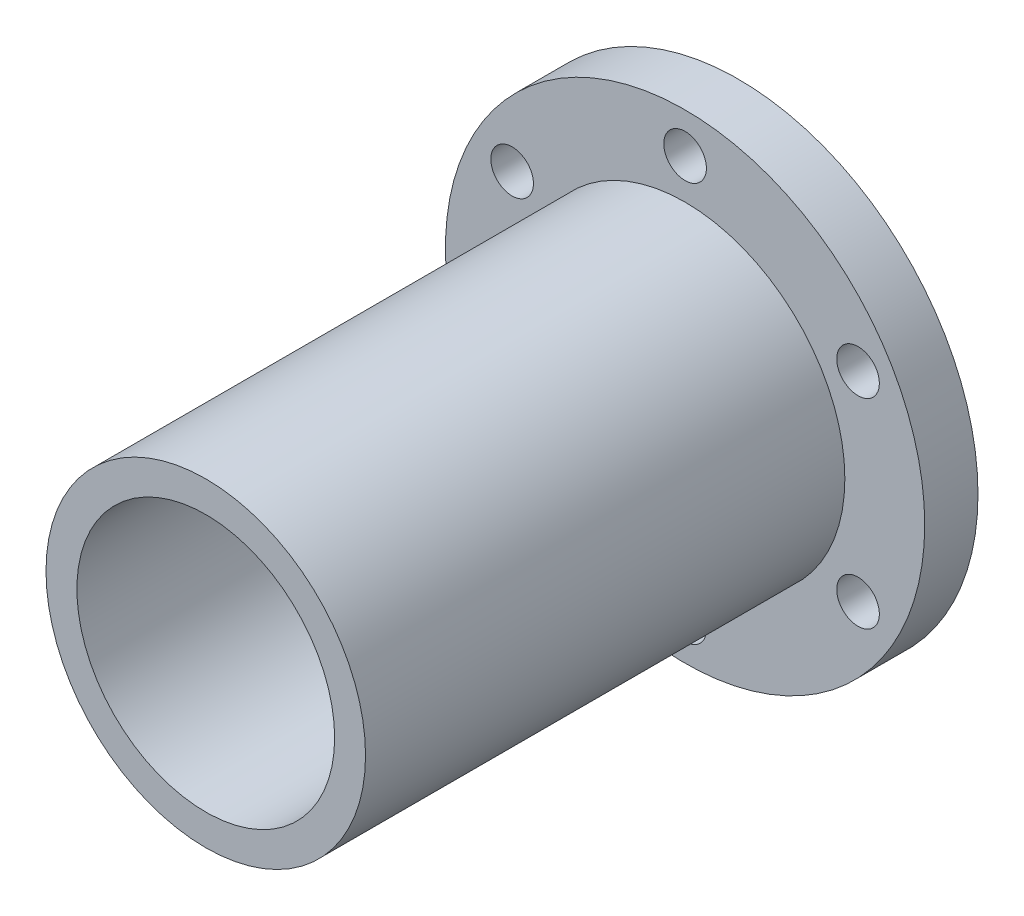
ISO-10303-21;
HEADER;
FILE_DESCRIPTION(('STEP AP214'),'2;1');
FILE_NAME('part.step','',(''),(''),'','','');
FILE_SCHEMA(('AUTOMOTIVE_DESIGN { 1 0 10303 214 1 1 1 1 }'));
ENDSEC;
DATA;
#1=APPLICATION_CONTEXT('core data for automotive mechanical design processes');
#2=APPLICATION_PROTOCOL_DEFINITION('international standard','automotive_design',2000,#1);
#3=PRODUCT_CONTEXT('',#1,'mechanical');
#4=PRODUCT('Part','Part','',(#3));
#5=PRODUCT_RELATED_PRODUCT_CATEGORY('part','',(#4));
#6=PRODUCT_DEFINITION_FORMATION('','',#4);
#7=PRODUCT_DEFINITION_CONTEXT('part definition',#1,'design');
#8=PRODUCT_DEFINITION('design','',#6,#7);
#9=PRODUCT_DEFINITION_SHAPE('','',#8);
#10=(LENGTH_UNIT() NAMED_UNIT(*) SI_UNIT(.MILLI.,.METRE.));
#11=(NAMED_UNIT(*) PLANE_ANGLE_UNIT() SI_UNIT($,.RADIAN.));
#12=(NAMED_UNIT(*) SI_UNIT($,.STERADIAN.) SOLID_ANGLE_UNIT());
#13=UNCERTAINTY_MEASURE_WITH_UNIT(LENGTH_MEASURE(1.E-05),#10,'distance_accuracy_value','');
#14=(GEOMETRIC_REPRESENTATION_CONTEXT(3) GLOBAL_UNCERTAINTY_ASSIGNED_CONTEXT((#13)) GLOBAL_UNIT_ASSIGNED_CONTEXT((#10,
#11,#12)) REPRESENTATION_CONTEXT('',''));
#15=CARTESIAN_POINT('',(0.,0.,0.));
#16=DIRECTION('',(0.,0.,1.));
#17=DIRECTION('',(1.,0.,0.));
#18=AXIS2_PLACEMENT_3D('',#15,#16,#17);
#19=CARTESIAN_POINT('',(0.,0.,5.));
#20=DIRECTION('',(0.,0.,-1.));
#21=DIRECTION('',(-1.,0.,0.));
#22=AXIS2_PLACEMENT_3D('',#19,#20,#21);
#23=CYLINDRICAL_SURFACE('',#22,22.5);
#24=CARTESIAN_POINT('',(0.,0.,5.));
#25=DIRECTION('',(0.,0.,1.));
#26=DIRECTION('',(1.,0.,0.));
#27=AXIS2_PLACEMENT_3D('',#24,#25,#26);
#28=CIRCLE('',#27,22.5);
#29=CARTESIAN_POINT('',(22.5,0.,5.));
#30=VERTEX_POINT('',#29);
#31=EDGE_CURVE('E40',#30,#30,#28,.T.);
#32=ORIENTED_EDGE('',*,*,#31,.F.);
#33=EDGE_LOOP('',(#32));
#34=FACE_BOUND('',#33,.T.);
#35=CARTESIAN_POINT('',(0.,0.,0.));
#36=DIRECTION('',(0.,0.,1.));
#37=DIRECTION('',(1.,0.,0.));
#38=AXIS2_PLACEMENT_3D('',#35,#36,#37);
#39=CIRCLE('',#38,22.5);
#40=CARTESIAN_POINT('',(22.5,0.,0.));
#41=VERTEX_POINT('',#40);
#42=EDGE_CURVE('E44',#41,#41,#39,.T.);
#43=ORIENTED_EDGE('',*,*,#42,.T.);
#44=EDGE_LOOP('',(#43));
#45=FACE_BOUND('',#44,.T.);
#46=ADVANCED_FACE('F34',(#34,#45),#23,.T.);
#47=CARTESIAN_POINT('',(0.,0.,5.));
#48=DIRECTION('',(0.,0.,1.));
#49=DIRECTION('',(1.,0.,0.));
#50=AXIS2_PLACEMENT_3D('',#47,#48,#49);
#51=PLANE('',#50);
#52=CARTESIAN_POINT('',(0.,18.75,5.));
#53=DIRECTION('',(0.,0.,1.));
#54=DIRECTION('',(1.,0.,0.));
#55=AXIS2_PLACEMENT_3D('',#52,#53,#54);
#56=CIRCLE('',#55,2.);
#57=CARTESIAN_POINT('',(2.,18.75,5.));
#58=VERTEX_POINT('',#57);
#59=EDGE_CURVE('E85',#58,#58,#56,.T.);
#60=ORIENTED_EDGE('',*,*,#59,.F.);
#61=EDGE_LOOP('',(#60));
#62=FACE_BOUND('',#61,.T.);
#63=CARTESIAN_POINT('',(-16.2379763209579,9.37499999999942,5.));
#64=DIRECTION('',(0.,0.,1.));
#65=DIRECTION('',(1.,0.,0.));
#66=AXIS2_PLACEMENT_3D('',#63,#64,#65);
#67=CIRCLE('',#66,2.);
#68=CARTESIAN_POINT('',(-14.2379763209579,9.37499999999942,5.));
#69=VERTEX_POINT('',#68);
#70=EDGE_CURVE('E86',#69,#69,#67,.T.);
#71=ORIENTED_EDGE('',*,*,#70,.F.);
#72=EDGE_LOOP('',(#71));
#73=FACE_BOUND('',#72,.T.);
#74=CARTESIAN_POINT('',(-16.2379763209572,-9.37500000000058,5.));
#75=DIRECTION('',(0.,0.,1.));
#76=DIRECTION('',(1.,0.,0.));
#77=AXIS2_PLACEMENT_3D('',#74,#75,#76);
#78=CIRCLE('',#77,2.);
#79=CARTESIAN_POINT('',(-14.2379763209572,-9.37500000000058,5.));
#80=VERTEX_POINT('',#79);
#81=EDGE_CURVE('E60',#80,#80,#78,.T.);
#82=ORIENTED_EDGE('',*,*,#81,.F.);
#83=EDGE_LOOP('',(#82));
#84=FACE_BOUND('',#83,.T.);
#85=CARTESIAN_POINT('',(1.32579492414538E-12,-18.75,5.));
#86=DIRECTION('',(0.,0.,1.));
#87=DIRECTION('',(1.,0.,0.));
#88=AXIS2_PLACEMENT_3D('',#85,#86,#87);
#89=CIRCLE('',#88,2.);
#90=CARTESIAN_POINT('',(2.00000000000133,-18.75,5.));
#91=VERTEX_POINT('',#90);
#92=EDGE_CURVE('E67',#91,#91,#89,.T.);
#93=ORIENTED_EDGE('',*,*,#92,.F.);
#94=EDGE_LOOP('',(#93));
#95=FACE_BOUND('',#94,.T.);
#96=CARTESIAN_POINT('',(16.2379763209592,-9.37499999999942,5.));
#97=DIRECTION('',(0.,0.,1.));
#98=DIRECTION('',(1.,0.,0.));
#99=AXIS2_PLACEMENT_3D('',#96,#97,#98);
#100=CIRCLE('',#99,2.00000000000001);
#101=CARTESIAN_POINT('',(18.2379763209592,-9.37499999999942,5.));
#102=VERTEX_POINT('',#101);
#103=EDGE_CURVE('E73',#102,#102,#100,.T.);
#104=ORIENTED_EDGE('',*,*,#103,.F.);
#105=EDGE_LOOP('',(#104));
#106=FACE_BOUND('',#105,.T.);
#107=CARTESIAN_POINT('',(16.2379763209586,9.37500000000058,5.));
#108=DIRECTION('',(0.,0.,1.));
#109=DIRECTION('',(1.,0.,0.));
#110=AXIS2_PLACEMENT_3D('',#107,#108,#109);
#111=CIRCLE('',#110,2.00000000000001);
#112=CARTESIAN_POINT('',(18.2379763209586,9.37500000000058,5.));
#113=VERTEX_POINT('',#112);
#114=EDGE_CURVE('E79',#113,#113,#111,.T.);
#115=ORIENTED_EDGE('',*,*,#114,.F.);
#116=EDGE_LOOP('',(#115));
#117=FACE_BOUND('',#116,.T.);
#118=CARTESIAN_POINT('',(0.,0.,5.));
#119=DIRECTION('',(0.,0.,1.));
#120=DIRECTION('',(1.,0.,0.));
#121=AXIS2_PLACEMENT_3D('',#118,#119,#120);
#122=CIRCLE('',#121,15.);
#123=CARTESIAN_POINT('',(15.,0.,5.));
#124=VERTEX_POINT('',#123);
#125=EDGE_CURVE('E51',#124,#124,#122,.T.);
#126=ORIENTED_EDGE('',*,*,#125,.F.);
#127=EDGE_LOOP('',(#126));
#128=FACE_BOUND('',#127,.T.);
#129=ORIENTED_EDGE('',*,*,#31,.T.);
#130=EDGE_LOOP('',(#129));
#131=FACE_BOUND('',#130,.T.);
#132=ADVANCED_FACE('F106',(#62,#73,#84,#95,#106,#117,#128,#131),#51,.T.);
#133=CARTESIAN_POINT('',(0.,0.,0.));
#134=DIRECTION('',(0.,0.,1.));
#135=DIRECTION('',(1.,0.,0.));
#136=AXIS2_PLACEMENT_3D('',#133,#134,#135);
#137=PLANE('',#136);
#138=CARTESIAN_POINT('',(0.,18.75,0.));
#139=DIRECTION('',(0.,0.,1.));
#140=DIRECTION('',(1.,0.,0.));
#141=AXIS2_PLACEMENT_3D('',#138,#139,#140);
#142=CIRCLE('',#141,2.);
#143=CARTESIAN_POINT('',(2.,18.75,0.));
#144=VERTEX_POINT('',#143);
#145=EDGE_CURVE('E59',#144,#144,#142,.T.);
#146=ORIENTED_EDGE('',*,*,#145,.T.);
#147=EDGE_LOOP('',(#146));
#148=FACE_BOUND('',#147,.T.);
#149=CARTESIAN_POINT('',(-16.2379763209579,9.37499999999942,0.));
#150=DIRECTION('',(0.,0.,1.));
#151=DIRECTION('',(1.,0.,0.));
#152=AXIS2_PLACEMENT_3D('',#149,#150,#151);
#153=CIRCLE('',#152,2.);
#154=CARTESIAN_POINT('',(-14.2379763209579,9.37499999999942,0.));
#155=VERTEX_POINT('',#154);
#156=EDGE_CURVE('E64',#155,#155,#153,.T.);
#157=ORIENTED_EDGE('',*,*,#156,.T.);
#158=EDGE_LOOP('',(#157));
#159=FACE_BOUND('',#158,.T.);
#160=CARTESIAN_POINT('',(-16.2379763209572,-9.37500000000058,0.));
#161=DIRECTION('',(0.,0.,1.));
#162=DIRECTION('',(1.,0.,0.));
#163=AXIS2_PLACEMENT_3D('',#160,#161,#162);
#164=CIRCLE('',#163,2.);
#165=CARTESIAN_POINT('',(-14.2379763209572,-9.37500000000058,0.));
#166=VERTEX_POINT('',#165);
#167=EDGE_CURVE('E63',#166,#166,#164,.T.);
#168=ORIENTED_EDGE('',*,*,#167,.T.);
#169=EDGE_LOOP('',(#168));
#170=FACE_BOUND('',#169,.T.);
#171=CARTESIAN_POINT('',(1.32579492414538E-12,-18.75,0.));
#172=DIRECTION('',(0.,0.,1.));
#173=DIRECTION('',(1.,0.,0.));
#174=AXIS2_PLACEMENT_3D('',#171,#172,#173);
#175=CIRCLE('',#174,2.);
#176=CARTESIAN_POINT('',(2.00000000000133,-18.75,0.));
#177=VERTEX_POINT('',#176);
#178=EDGE_CURVE('E70',#177,#177,#175,.T.);
#179=ORIENTED_EDGE('',*,*,#178,.T.);
#180=EDGE_LOOP('',(#179));
#181=FACE_BOUND('',#180,.T.);
#182=CARTESIAN_POINT('',(16.2379763209592,-9.37499999999942,0.));
#183=DIRECTION('',(0.,0.,1.));
#184=DIRECTION('',(1.,0.,0.));
#185=AXIS2_PLACEMENT_3D('',#182,#183,#184);
#186=CIRCLE('',#185,2.00000000000001);
#187=CARTESIAN_POINT('',(18.2379763209592,-9.37499999999942,0.));
#188=VERTEX_POINT('',#187);
#189=EDGE_CURVE('E76',#188,#188,#186,.T.);
#190=ORIENTED_EDGE('',*,*,#189,.T.);
#191=EDGE_LOOP('',(#190));
#192=FACE_BOUND('',#191,.T.);
#193=CARTESIAN_POINT('',(16.2379763209586,9.37500000000058,0.));
#194=DIRECTION('',(0.,0.,1.));
#195=DIRECTION('',(1.,0.,0.));
#196=AXIS2_PLACEMENT_3D('',#193,#194,#195);
#197=CIRCLE('',#196,2.00000000000001);
#198=CARTESIAN_POINT('',(18.2379763209586,9.37500000000058,0.));
#199=VERTEX_POINT('',#198);
#200=EDGE_CURVE('E82',#199,#199,#197,.T.);
#201=ORIENTED_EDGE('',*,*,#200,.T.);
#202=EDGE_LOOP('',(#201));
#203=FACE_BOUND('',#202,.T.);
#204=ORIENTED_EDGE('',*,*,#42,.F.);
#205=EDGE_LOOP('',(#204));
#206=FACE_BOUND('',#205,.T.);
#207=ADVANCED_FACE('F96',(#148,#159,#170,#181,#192,#203,#206),#137,.F.);
#208=CARTESIAN_POINT('',(0.,0.,50.));
#209=DIRECTION('',(0.,0.,1.));
#210=DIRECTION('',(1.,0.,0.));
#211=AXIS2_PLACEMENT_3D('',#208,#209,#210);
#212=PLANE('',#211);
#213=CARTESIAN_POINT('',(0.,0.,50.));
#214=DIRECTION('',(0.,0.,1.));
#215=DIRECTION('',(1.,0.,0.));
#216=AXIS2_PLACEMENT_3D('',#213,#214,#215);
#217=CIRCLE('',#216,15.);
#218=CARTESIAN_POINT('',(15.,0.,50.));
#219=VERTEX_POINT('',#218);
#220=EDGE_CURVE('E49',#219,#219,#217,.T.);
#221=ORIENTED_EDGE('',*,*,#220,.T.);
#222=EDGE_LOOP('',(#221));
#223=FACE_BOUND('',#222,.T.);
#224=CARTESIAN_POINT('',(0.,0.,50.));
#225=DIRECTION('',(0.,0.,1.));
#226=DIRECTION('',(1.,0.,0.));
#227=AXIS2_PLACEMENT_3D('',#224,#225,#226);
#228=CIRCLE('',#227,12.1);
#229=CARTESIAN_POINT('',(12.1,0.,50.));
#230=VERTEX_POINT('',#229);
#231=EDGE_CURVE('E54',#230,#230,#228,.T.);
#232=ORIENTED_EDGE('',*,*,#231,.F.);
#233=EDGE_LOOP('',(#232));
#234=FACE_BOUND('',#233,.T.);
#235=ADVANCED_FACE('F126',(#223,#234),#212,.T.);
#236=CARTESIAN_POINT('',(0.,0.,50.));
#237=DIRECTION('',(0.,0.,-1.));
#238=DIRECTION('',(-1.,0.,0.));
#239=AXIS2_PLACEMENT_3D('',#236,#237,#238);
#240=CYLINDRICAL_SURFACE('',#239,15.);
#241=ORIENTED_EDGE('',*,*,#220,.F.);
#242=EDGE_LOOP('',(#241));
#243=FACE_BOUND('',#242,.T.);
#244=ORIENTED_EDGE('',*,*,#125,.T.);
#245=EDGE_LOOP('',(#244));
#246=FACE_BOUND('',#245,.T.);
#247=ADVANCED_FACE('F123',(#243,#246),#240,.T.);
#248=CARTESIAN_POINT('',(0.,0.,50.));
#249=DIRECTION('',(0.,0.,-1.));
#250=DIRECTION('',(-1.,0.,0.));
#251=AXIS2_PLACEMENT_3D('',#248,#249,#250);
#252=CYLINDRICAL_SURFACE('',#251,12.1);
#253=ORIENTED_EDGE('',*,*,#231,.T.);
#254=EDGE_LOOP('',(#253));
#255=FACE_BOUND('',#254,.T.);
#256=CARTESIAN_POINT('',(0.,0.,5.));
#257=DIRECTION('',(0.,0.,1.));
#258=DIRECTION('',(1.,0.,0.));
#259=AXIS2_PLACEMENT_3D('',#256,#257,#258);
#260=CIRCLE('',#259,12.1);
#261=CARTESIAN_POINT('',(12.1,0.,5.));
#262=VERTEX_POINT('',#261);
#263=EDGE_CURVE('E10',#262,#262,#260,.F.);
#264=ORIENTED_EDGE('',*,*,#263,.T.);
#265=EDGE_LOOP('',(#264));
#266=FACE_BOUND('',#265,.T.);
#267=ADVANCED_FACE('F125',(#255,#266),#252,.F.);
#268=ORIENTED_EDGE('',*,*,#263,.F.);
#269=EDGE_LOOP('',(#268));
#270=FACE_BOUND('',#269,.T.);
#271=ADVANCED_FACE('F110',(#270),#51,.T.);
#272=CARTESIAN_POINT('',(16.2379763209586,9.37500000000058,0.));
#273=DIRECTION('',(0.,0.,1.));
#274=DIRECTION('',(1.,0.,0.));
#275=AXIS2_PLACEMENT_3D('',#272,#273,#274);
#276=CYLINDRICAL_SURFACE('',#275,2.00000000000001);
#277=ORIENTED_EDGE('',*,*,#200,.F.);
#278=EDGE_LOOP('',(#277));
#279=FACE_BOUND('',#278,.T.);
#280=ORIENTED_EDGE('',*,*,#114,.T.);
#281=EDGE_LOOP('',(#280));
#282=FACE_BOUND('',#281,.T.);
#283=ADVANCED_FACE('F176',(#279,#282),#276,.F.);
#284=CARTESIAN_POINT('',(16.2379763209592,-9.37499999999942,0.));
#285=DIRECTION('',(0.,0.,1.));
#286=DIRECTION('',(1.,0.,0.));
#287=AXIS2_PLACEMENT_3D('',#284,#285,#286);
#288=CYLINDRICAL_SURFACE('',#287,2.00000000000001);
#289=ORIENTED_EDGE('',*,*,#189,.F.);
#290=EDGE_LOOP('',(#289));
#291=FACE_BOUND('',#290,.T.);
#292=ORIENTED_EDGE('',*,*,#103,.T.);
#293=EDGE_LOOP('',(#292));
#294=FACE_BOUND('',#293,.T.);
#295=ADVANCED_FACE('F192',(#291,#294),#288,.F.);
#296=CARTESIAN_POINT('',(1.32579492414538E-12,-18.75,0.));
#297=DIRECTION('',(0.,0.,1.));
#298=DIRECTION('',(1.,0.,0.));
#299=AXIS2_PLACEMENT_3D('',#296,#297,#298);
#300=CYLINDRICAL_SURFACE('',#299,2.);
#301=ORIENTED_EDGE('',*,*,#178,.F.);
#302=EDGE_LOOP('',(#301));
#303=FACE_BOUND('',#302,.T.);
#304=ORIENTED_EDGE('',*,*,#92,.T.);
#305=EDGE_LOOP('',(#304));
#306=FACE_BOUND('',#305,.T.);
#307=ADVANCED_FACE('F199',(#303,#306),#300,.F.);
#308=CARTESIAN_POINT('',(-16.2379763209572,-9.37500000000058,0.));
#309=DIRECTION('',(0.,0.,1.));
#310=DIRECTION('',(1.,0.,0.));
#311=AXIS2_PLACEMENT_3D('',#308,#309,#310);
#312=CYLINDRICAL_SURFACE('',#311,2.);
#313=ORIENTED_EDGE('',*,*,#167,.F.);
#314=EDGE_LOOP('',(#313));
#315=FACE_BOUND('',#314,.T.);
#316=ORIENTED_EDGE('',*,*,#81,.T.);
#317=EDGE_LOOP('',(#316));
#318=FACE_BOUND('',#317,.T.);
#319=ADVANCED_FACE('F207',(#315,#318),#312,.F.);
#320=CARTESIAN_POINT('',(-16.2379763209579,9.37499999999942,0.));
#321=DIRECTION('',(0.,0.,1.));
#322=DIRECTION('',(1.,0.,0.));
#323=AXIS2_PLACEMENT_3D('',#320,#321,#322);
#324=CYLINDRICAL_SURFACE('',#323,2.);
#325=ORIENTED_EDGE('',*,*,#156,.F.);
#326=EDGE_LOOP('',(#325));
#327=FACE_BOUND('',#326,.T.);
#328=ORIENTED_EDGE('',*,*,#70,.T.);
#329=EDGE_LOOP('',(#328));
#330=FACE_BOUND('',#329,.T.);
#331=ADVANCED_FACE('F102',(#327,#330),#324,.F.);
#332=CARTESIAN_POINT('',(0.,18.75,0.));
#333=DIRECTION('',(0.,0.,1.));
#334=DIRECTION('',(1.,0.,0.));
#335=AXIS2_PLACEMENT_3D('',#332,#333,#334);
#336=CYLINDRICAL_SURFACE('',#335,2.);
#337=ORIENTED_EDGE('',*,*,#145,.F.);
#338=EDGE_LOOP('',(#337));
#339=FACE_BOUND('',#338,.T.);
#340=ORIENTED_EDGE('',*,*,#59,.T.);
#341=EDGE_LOOP('',(#340));
#342=FACE_BOUND('',#341,.T.);
#343=ADVANCED_FACE('F99',(#339,#342),#336,.F.);
#344=CLOSED_SHELL('',(#46,#132,#207,#235,#247,#267,#271,#283,#295,#307,#319,#331,#343));
#345=MANIFOLD_SOLID_BREP('B2',#344);
#346=ADVANCED_BREP_SHAPE_REPRESENTATION('',(#18,#345),#14);
#347=SHAPE_DEFINITION_REPRESENTATION(#9,#346);
ENDSEC;
END-ISO-10303-21;
